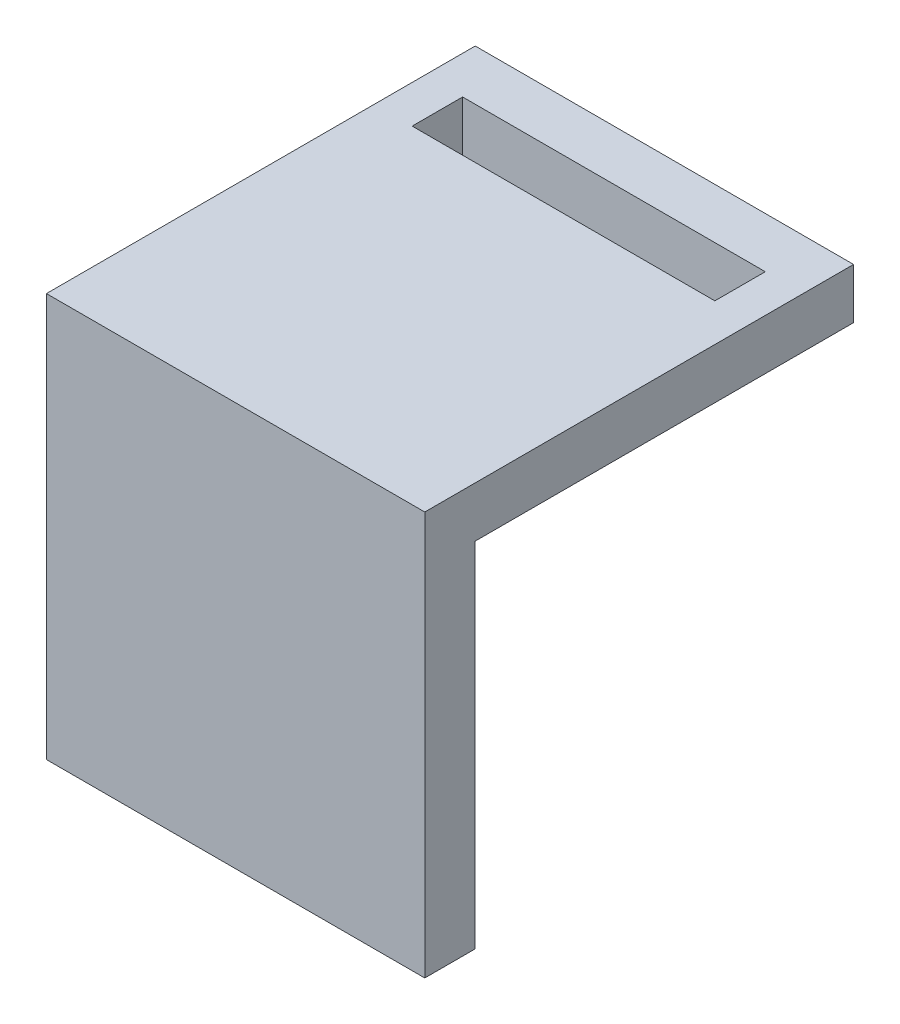
ISO-10303-21;
HEADER;
FILE_DESCRIPTION(('STEP AP214'),'2;1');
FILE_NAME('part.step','',(''),(''),'','','');
FILE_SCHEMA(('AUTOMOTIVE_DESIGN { 1 0 10303 214 1 1 1 1 }'));
ENDSEC;
DATA;
#1=APPLICATION_CONTEXT('core data for automotive mechanical design processes');
#2=APPLICATION_PROTOCOL_DEFINITION('international standard','automotive_design',2000,#1);
#3=PRODUCT_CONTEXT('',#1,'mechanical');
#4=PRODUCT('Part','Part','',(#3));
#5=PRODUCT_RELATED_PRODUCT_CATEGORY('part','',(#4));
#6=PRODUCT_DEFINITION_FORMATION('','',#4);
#7=PRODUCT_DEFINITION_CONTEXT('part definition',#1,'design');
#8=PRODUCT_DEFINITION('design','',#6,#7);
#9=PRODUCT_DEFINITION_SHAPE('','',#8);
#10=(LENGTH_UNIT() NAMED_UNIT(*) SI_UNIT(.MILLI.,.METRE.));
#11=(NAMED_UNIT(*) PLANE_ANGLE_UNIT() SI_UNIT($,.RADIAN.));
#12=(NAMED_UNIT(*) SI_UNIT($,.STERADIAN.) SOLID_ANGLE_UNIT());
#13=UNCERTAINTY_MEASURE_WITH_UNIT(LENGTH_MEASURE(1.E-05),#10,'distance_accuracy_value','');
#14=(GEOMETRIC_REPRESENTATION_CONTEXT(3) GLOBAL_UNCERTAINTY_ASSIGNED_CONTEXT((#13)) GLOBAL_UNIT_ASSIGNED_CONTEXT((#10,
#11,#12)) REPRESENTATION_CONTEXT('',''));
#15=CARTESIAN_POINT('',(0.,0.,0.));
#16=DIRECTION('',(0.,0.,1.));
#17=DIRECTION('',(1.,0.,0.));
#18=AXIS2_PLACEMENT_3D('',#15,#16,#17);
#19=CARTESIAN_POINT('',(-98.9821928985398,20.8954080859731,5.08));
#20=DIRECTION('',(-1.,0.,0.));
#21=DIRECTION('',(0.,0.,1.));
#22=AXIS2_PLACEMENT_3D('',#19,#20,#21);
#23=PLANE('',#22);
#24=DIRECTION('',(0.,1.,0.));
#25=VECTOR('',#24,1.);
#26=CARTESIAN_POINT('',(-98.9821928985398,20.8954080859731,0.));
#27=LINE('',#26,#25);
#28=CARTESIAN_POINT('',(-98.9821928985398,-14.6645919140269,0.));
#29=VERTEX_POINT('',#28);
#30=CARTESIAN_POINT('',(-98.9821928985398,20.8954080859731,0.));
#31=VERTEX_POINT('',#30);
#32=EDGE_CURVE('E128',#29,#31,#27,.T.);
#33=ORIENTED_EDGE('',*,*,#32,.T.);
#34=DIRECTION('',(0.,0.,-1.));
#35=VECTOR('',#34,1.);
#36=CARTESIAN_POINT('',(-98.9821928985398,20.8954080859731,5.08));
#37=LINE('',#36,#35);
#38=CARTESIAN_POINT('',(-98.9821928985398,20.8954080859731,-38.1));
#39=VERTEX_POINT('',#38);
#40=EDGE_CURVE('E169',#31,#39,#37,.T.);
#41=ORIENTED_EDGE('',*,*,#40,.T.);
#42=DIRECTION('',(0.,-1.,0.));
#43=VECTOR('',#42,1.);
#44=CARTESIAN_POINT('',(-98.9821928985398,25.9754080859731,-38.1));
#45=LINE('',#44,#43);
#46=CARTESIAN_POINT('',(-98.9821928985398,25.9754080859731,-38.1));
#47=VERTEX_POINT('',#46);
#48=EDGE_CURVE('E132',#47,#39,#45,.T.);
#49=ORIENTED_EDGE('',*,*,#48,.F.);
#50=DIRECTION('',(0.,0.,-1.));
#51=VECTOR('',#50,1.);
#52=CARTESIAN_POINT('',(-98.9821928985398,25.9754080859731,5.08));
#53=LINE('',#52,#51);
#54=CARTESIAN_POINT('',(-98.9821928985398,25.9754080859731,5.08));
#55=VERTEX_POINT('',#54);
#56=EDGE_CURVE('E194',#55,#47,#53,.T.);
#57=ORIENTED_EDGE('',*,*,#56,.F.);
#58=DIRECTION('',(0.,1.,0.));
#59=VECTOR('',#58,1.);
#60=CARTESIAN_POINT('',(-98.9821928985398,20.8954080859731,5.08));
#61=LINE('',#60,#59);
#62=CARTESIAN_POINT('',(-98.9821928985398,-14.6645919140269,5.08));
#63=VERTEX_POINT('',#62);
#64=EDGE_CURVE('E146',#63,#55,#61,.T.);
#65=ORIENTED_EDGE('',*,*,#64,.F.);
#66=DIRECTION('',(0.,0.,-1.));
#67=VECTOR('',#66,1.);
#68=CARTESIAN_POINT('',(-98.9821928985398,-14.6645919140269,5.08));
#69=LINE('',#68,#67);
#70=EDGE_CURVE('E147',#63,#29,#69,.T.);
#71=ORIENTED_EDGE('',*,*,#70,.T.);
#72=EDGE_LOOP('',(#33,#41,#49,#57,#65,#71));
#73=FACE_BOUND('',#72,.T.);
#74=ADVANCED_FACE('F32',(#73),#23,.F.);
#75=CARTESIAN_POINT('',(-137.08219289854,20.8954080859731,5.08));
#76=DIRECTION('',(1.,0.,0.));
#77=DIRECTION('',(0.,0.,-1.));
#78=AXIS2_PLACEMENT_3D('',#75,#76,#77);
#79=PLANE('',#78);
#80=DIRECTION('',(0.,-1.,0.));
#81=VECTOR('',#80,1.);
#82=CARTESIAN_POINT('',(-137.08219289854,20.8954080859731,0.));
#83=LINE('',#82,#81);
#84=CARTESIAN_POINT('',(-137.08219289854,20.8954080859731,0.));
#85=VERTEX_POINT('',#84);
#86=CARTESIAN_POINT('',(-137.08219289854,-14.6645919140269,0.));
#87=VERTEX_POINT('',#86);
#88=EDGE_CURVE('E136',#85,#87,#83,.T.);
#89=ORIENTED_EDGE('',*,*,#88,.T.);
#90=DIRECTION('',(0.,0.,-1.));
#91=VECTOR('',#90,1.);
#92=CARTESIAN_POINT('',(-137.08219289854,-14.6645919140269,5.08));
#93=LINE('',#92,#91);
#94=CARTESIAN_POINT('',(-137.08219289854,-14.6645919140269,5.08));
#95=VERTEX_POINT('',#94);
#96=EDGE_CURVE('E110',#95,#87,#93,.T.);
#97=ORIENTED_EDGE('',*,*,#96,.F.);
#98=DIRECTION('',(0.,-1.,0.));
#99=VECTOR('',#98,1.);
#100=CARTESIAN_POINT('',(-137.08219289854,20.8954080859731,5.08));
#101=LINE('',#100,#99);
#102=CARTESIAN_POINT('',(-137.08219289854,25.9754080859731,5.08));
#103=VERTEX_POINT('',#102);
#104=EDGE_CURVE('E226',#103,#95,#101,.T.);
#105=ORIENTED_EDGE('',*,*,#104,.F.);
#106=DIRECTION('',(0.,0.,1.));
#107=VECTOR('',#106,1.);
#108=CARTESIAN_POINT('',(-137.08219289854,25.9754080859731,5.08));
#109=LINE('',#108,#107);
#110=CARTESIAN_POINT('',(-137.08219289854,25.9754080859731,-38.1));
#111=VERTEX_POINT('',#110);
#112=EDGE_CURVE('E175',#111,#103,#109,.T.);
#113=ORIENTED_EDGE('',*,*,#112,.F.);
#114=DIRECTION('',(0.,-1.,0.));
#115=VECTOR('',#114,1.);
#116=CARTESIAN_POINT('',(-137.08219289854,25.9754080859731,-38.1));
#117=LINE('',#116,#115);
#118=CARTESIAN_POINT('',(-137.08219289854,20.8954080859731,-38.1));
#119=VERTEX_POINT('',#118);
#120=EDGE_CURVE('E187',#111,#119,#117,.T.);
#121=ORIENTED_EDGE('',*,*,#120,.T.);
#122=DIRECTION('',(0.,0.,1.));
#123=VECTOR('',#122,1.);
#124=CARTESIAN_POINT('',(-137.08219289854,20.8954080859731,5.08));
#125=LINE('',#124,#123);
#126=EDGE_CURVE('E158',#119,#85,#125,.T.);
#127=ORIENTED_EDGE('',*,*,#126,.T.);
#128=EDGE_LOOP('',(#89,#97,#105,#113,#121,#127));
#129=FACE_BOUND('',#128,.T.);
#130=ADVANCED_FACE('F154',(#129),#79,.F.);
#131=CARTESIAN_POINT('',(-137.08219289854,-14.6645919140269,5.08));
#132=DIRECTION('',(0.,1.,0.));
#133=DIRECTION('',(0.,0.,1.));
#134=AXIS2_PLACEMENT_3D('',#131,#132,#133);
#135=PLANE('',#134);
#136=DIRECTION('',(1.,0.,0.));
#137=VECTOR('',#136,1.);
#138=CARTESIAN_POINT('',(-137.08219289854,-14.6645919140269,0.));
#139=LINE('',#138,#137);
#140=EDGE_CURVE('E144',#87,#29,#139,.T.);
#141=ORIENTED_EDGE('',*,*,#140,.T.);
#142=ORIENTED_EDGE('',*,*,#70,.F.);
#143=DIRECTION('',(1.,0.,0.));
#144=VECTOR('',#143,1.);
#145=CARTESIAN_POINT('',(-137.08219289854,-14.6645919140269,5.08));
#146=LINE('',#145,#144);
#147=EDGE_CURVE('E142',#95,#63,#146,.T.);
#148=ORIENTED_EDGE('',*,*,#147,.F.);
#149=ORIENTED_EDGE('',*,*,#96,.T.);
#150=EDGE_LOOP('',(#141,#142,#148,#149));
#151=FACE_BOUND('',#150,.T.);
#152=ADVANCED_FACE('F162',(#151),#135,.F.);
#153=CARTESIAN_POINT('',(-98.9821928985398,-14.6645919140269,5.08));
#154=DIRECTION('',(0.,0.,1.));
#155=DIRECTION('',(1.,0.,0.));
#156=AXIS2_PLACEMENT_3D('',#153,#154,#155);
#157=PLANE('',#156);
#158=ORIENTED_EDGE('',*,*,#64,.T.);
#159=DIRECTION('',(1.,0.,0.));
#160=VECTOR('',#159,1.);
#161=CARTESIAN_POINT('',(-137.08219289854,25.9754080859731,5.08));
#162=LINE('',#161,#160);
#163=EDGE_CURVE('E197',#103,#55,#162,.T.);
#164=ORIENTED_EDGE('',*,*,#163,.F.);
#165=ORIENTED_EDGE('',*,*,#104,.T.);
#166=ORIENTED_EDGE('',*,*,#147,.T.);
#167=EDGE_LOOP('',(#158,#164,#165,#166));
#168=FACE_BOUND('',#167,.T.);
#169=ADVANCED_FACE('F228',(#168),#157,.T.);
#170=CARTESIAN_POINT('',(-98.9821928985398,-14.6645919140269,0.));
#171=DIRECTION('',(0.,0.,1.));
#172=DIRECTION('',(1.,0.,0.));
#173=AXIS2_PLACEMENT_3D('',#170,#171,#172);
#174=PLANE('',#173);
#175=ORIENTED_EDGE('',*,*,#32,.F.);
#176=ORIENTED_EDGE('',*,*,#140,.F.);
#177=ORIENTED_EDGE('',*,*,#88,.F.);
#178=DIRECTION('',(-1.,0.,0.));
#179=VECTOR('',#178,1.);
#180=CARTESIAN_POINT('',(-137.08219289854,20.8954080859731,0.));
#181=LINE('',#180,#179);
#182=EDGE_CURVE('E131',#31,#85,#181,.T.);
#183=ORIENTED_EDGE('',*,*,#182,.F.);
#184=EDGE_LOOP('',(#175,#176,#177,#183));
#185=FACE_BOUND('',#184,.T.);
#186=ADVANCED_FACE('F165',(#185),#174,.F.);
#187=CARTESIAN_POINT('',(-137.08219289854,25.9754080859731,-38.1));
#188=DIRECTION('',(0.,0.,1.));
#189=DIRECTION('',(1.,0.,0.));
#190=AXIS2_PLACEMENT_3D('',#187,#188,#189);
#191=PLANE('',#190);
#192=DIRECTION('',(-1.,0.,0.));
#193=VECTOR('',#192,1.);
#194=CARTESIAN_POINT('',(-137.08219289854,20.8954080859731,-38.1));
#195=LINE('',#194,#193);
#196=EDGE_CURVE('E173',#39,#119,#195,.T.);
#197=ORIENTED_EDGE('',*,*,#196,.T.);
#198=ORIENTED_EDGE('',*,*,#120,.F.);
#199=DIRECTION('',(-1.,0.,0.));
#200=VECTOR('',#199,1.);
#201=CARTESIAN_POINT('',(-137.08219289854,25.9754080859731,-38.1));
#202=LINE('',#201,#200);
#203=EDGE_CURVE('E188',#47,#111,#202,.T.);
#204=ORIENTED_EDGE('',*,*,#203,.F.);
#205=ORIENTED_EDGE('',*,*,#48,.T.);
#206=EDGE_LOOP('',(#197,#198,#204,#205));
#207=FACE_BOUND('',#206,.T.);
#208=ADVANCED_FACE('F191',(#207),#191,.F.);
#209=CARTESIAN_POINT('',(-137.08219289854,25.9754080859731,-38.1));
#210=DIRECTION('',(0.,-1.,0.));
#211=DIRECTION('',(0.,0.,-1.));
#212=AXIS2_PLACEMENT_3D('',#209,#210,#211);
#213=PLANE('',#212);
#214=DIRECTION('',(0.,0.,-1.));
#215=VECTOR('',#214,1.);
#216=CARTESIAN_POINT('',(-102.79219289854,25.9754080859731,-38.1));
#217=LINE('',#216,#215);
#218=CARTESIAN_POINT('',(-102.79219289854,25.9754080859731,-27.94));
#219=VERTEX_POINT('',#218);
#220=CARTESIAN_POINT('',(-102.79219289854,25.9754080859731,-33.02));
#221=VERTEX_POINT('',#220);
#222=EDGE_CURVE('E117',#219,#221,#217,.T.);
#223=ORIENTED_EDGE('',*,*,#222,.F.);
#224=DIRECTION('',(-1.,0.,0.));
#225=VECTOR('',#224,1.);
#226=CARTESIAN_POINT('',(-137.08219289854,25.9754080859731,-27.94));
#227=LINE('',#226,#225);
#228=CARTESIAN_POINT('',(-133.27219289854,25.9754080859731,-27.94));
#229=VERTEX_POINT('',#228);
#230=EDGE_CURVE('E205',#219,#229,#227,.T.);
#231=ORIENTED_EDGE('',*,*,#230,.T.);
#232=DIRECTION('',(0.,0.,1.));
#233=VECTOR('',#232,1.);
#234=CARTESIAN_POINT('',(-133.27219289854,25.9754080859731,-38.1));
#235=LINE('',#234,#233);
#236=CARTESIAN_POINT('',(-133.27219289854,25.9754080859731,-33.02));
#237=VERTEX_POINT('',#236);
#238=EDGE_CURVE('E177',#237,#229,#235,.T.);
#239=ORIENTED_EDGE('',*,*,#238,.F.);
#240=DIRECTION('',(-1.,0.,0.));
#241=VECTOR('',#240,1.);
#242=CARTESIAN_POINT('',(-137.08219289854,25.9754080859731,-33.02));
#243=LINE('',#242,#241);
#244=EDGE_CURVE('E208',#221,#237,#243,.T.);
#245=ORIENTED_EDGE('',*,*,#244,.F.);
#246=EDGE_LOOP('',(#223,#231,#239,#245));
#247=FACE_BOUND('',#246,.T.);
#248=ORIENTED_EDGE('',*,*,#112,.T.);
#249=ORIENTED_EDGE('',*,*,#163,.T.);
#250=ORIENTED_EDGE('',*,*,#56,.T.);
#251=ORIENTED_EDGE('',*,*,#203,.T.);
#252=EDGE_LOOP('',(#248,#249,#250,#251));
#253=FACE_BOUND('',#252,.T.);
#254=ADVANCED_FACE('F221',(#247,#253),#213,.F.);
#255=CARTESIAN_POINT('',(-137.08219289854,20.8954080859731,-38.1));
#256=DIRECTION('',(0.,-1.,0.));
#257=DIRECTION('',(0.,0.,-1.));
#258=AXIS2_PLACEMENT_3D('',#255,#256,#257);
#259=PLANE('',#258);
#260=DIRECTION('',(-1.,0.,0.));
#261=VECTOR('',#260,1.);
#262=CARTESIAN_POINT('',(-137.08219289854,20.8954080859731,-27.94));
#263=LINE('',#262,#261);
#264=CARTESIAN_POINT('',(-102.79219289854,20.8954080859731,-27.94));
#265=VERTEX_POINT('',#264);
#266=CARTESIAN_POINT('',(-133.27219289854,20.8954080859731,-27.94));
#267=VERTEX_POINT('',#266);
#268=EDGE_CURVE('E11',#265,#267,#263,.T.);
#269=ORIENTED_EDGE('',*,*,#268,.F.);
#270=DIRECTION('',(0.,0.,-1.));
#271=VECTOR('',#270,1.);
#272=CARTESIAN_POINT('',(-102.79219289854,20.8954080859731,-38.1));
#273=LINE('',#272,#271);
#274=CARTESIAN_POINT('',(-102.79219289854,20.8954080859731,-33.02));
#275=VERTEX_POINT('',#274);
#276=EDGE_CURVE('E109',#265,#275,#273,.T.);
#277=ORIENTED_EDGE('',*,*,#276,.T.);
#278=DIRECTION('',(-1.,0.,0.));
#279=VECTOR('',#278,1.);
#280=CARTESIAN_POINT('',(-137.08219289854,20.8954080859731,-33.02));
#281=LINE('',#280,#279);
#282=CARTESIAN_POINT('',(-133.27219289854,20.8954080859731,-33.02));
#283=VERTEX_POINT('',#282);
#284=EDGE_CURVE('E104',#275,#283,#281,.T.);
#285=ORIENTED_EDGE('',*,*,#284,.T.);
#286=DIRECTION('',(0.,0.,1.));
#287=VECTOR('',#286,1.);
#288=CARTESIAN_POINT('',(-133.27219289854,20.8954080859731,-38.1));
#289=LINE('',#288,#287);
#290=EDGE_CURVE('E39',#283,#267,#289,.T.);
#291=ORIENTED_EDGE('',*,*,#290,.T.);
#292=EDGE_LOOP('',(#269,#277,#285,#291));
#293=FACE_BOUND('',#292,.T.);
#294=ORIENTED_EDGE('',*,*,#40,.F.);
#295=ORIENTED_EDGE('',*,*,#182,.T.);
#296=ORIENTED_EDGE('',*,*,#126,.F.);
#297=ORIENTED_EDGE('',*,*,#196,.F.);
#298=EDGE_LOOP('',(#294,#295,#296,#297));
#299=FACE_BOUND('',#298,.T.);
#300=ADVANCED_FACE('F122',(#293,#299),#259,.T.);
#301=CARTESIAN_POINT('',(-133.27219289854,-14.8540776052966,-27.94));
#302=DIRECTION('',(1.,0.,0.));
#303=DIRECTION('',(0.,0.,-1.));
#304=AXIS2_PLACEMENT_3D('',#301,#302,#303);
#305=PLANE('',#304);
#306=ORIENTED_EDGE('',*,*,#238,.T.);
#307=DIRECTION('',(0.,-1.,0.));
#308=VECTOR('',#307,1.);
#309=CARTESIAN_POINT('',(-133.27219289854,-14.8540776052966,-27.94));
#310=LINE('',#309,#308);
#311=EDGE_CURVE('E119',#229,#267,#310,.T.);
#312=ORIENTED_EDGE('',*,*,#311,.T.);
#313=ORIENTED_EDGE('',*,*,#290,.F.);
#314=DIRECTION('',(0.,-1.,0.));
#315=VECTOR('',#314,1.);
#316=CARTESIAN_POINT('',(-133.27219289854,-14.8540776052966,-33.02));
#317=LINE('',#316,#315);
#318=EDGE_CURVE('E51',#237,#283,#317,.T.);
#319=ORIENTED_EDGE('',*,*,#318,.F.);
#320=EDGE_LOOP('',(#306,#312,#313,#319));
#321=FACE_BOUND('',#320,.T.);
#322=ADVANCED_FACE('F216',(#321),#305,.T.);
#323=CARTESIAN_POINT('',(-102.79219289854,-14.8540776052966,-27.94));
#324=DIRECTION('',(-1.,0.,0.));
#325=DIRECTION('',(0.,0.,1.));
#326=AXIS2_PLACEMENT_3D('',#323,#324,#325);
#327=PLANE('',#326);
#328=ORIENTED_EDGE('',*,*,#222,.T.);
#329=DIRECTION('',(0.,1.,0.));
#330=VECTOR('',#329,1.);
#331=CARTESIAN_POINT('',(-102.79219289854,-14.8540776052966,-33.02));
#332=LINE('',#331,#330);
#333=EDGE_CURVE('E46',#275,#221,#332,.T.);
#334=ORIENTED_EDGE('',*,*,#333,.F.);
#335=ORIENTED_EDGE('',*,*,#276,.F.);
#336=DIRECTION('',(0.,1.,0.));
#337=VECTOR('',#336,1.);
#338=CARTESIAN_POINT('',(-102.79219289854,-14.8540776052966,-27.94));
#339=LINE('',#338,#337);
#340=EDGE_CURVE('E209',#265,#219,#339,.T.);
#341=ORIENTED_EDGE('',*,*,#340,.T.);
#342=EDGE_LOOP('',(#328,#334,#335,#341));
#343=FACE_BOUND('',#342,.T.);
#344=ADVANCED_FACE('F113',(#343),#327,.T.);
#345=CARTESIAN_POINT('',(-102.79219289854,61.3459223947034,-27.94));
#346=DIRECTION('',(0.,0.,1.));
#347=DIRECTION('',(0.,1.,0.));
#348=AXIS2_PLACEMENT_3D('',#345,#346,#347);
#349=PLANE('',#348);
#350=ORIENTED_EDGE('',*,*,#340,.F.);
#351=ORIENTED_EDGE('',*,*,#268,.T.);
#352=ORIENTED_EDGE('',*,*,#311,.F.);
#353=ORIENTED_EDGE('',*,*,#230,.F.);
#354=EDGE_LOOP('',(#350,#351,#352,#353));
#355=FACE_BOUND('',#354,.T.);
#356=ADVANCED_FACE('F219',(#355),#349,.F.);
#357=CARTESIAN_POINT('',(-102.79219289854,61.3459223947034,-33.02));
#358=DIRECTION('',(0.,0.,1.));
#359=DIRECTION('',(0.,1.,0.));
#360=AXIS2_PLACEMENT_3D('',#357,#358,#359);
#361=PLANE('',#360);
#362=ORIENTED_EDGE('',*,*,#244,.T.);
#363=ORIENTED_EDGE('',*,*,#318,.T.);
#364=ORIENTED_EDGE('',*,*,#284,.F.);
#365=ORIENTED_EDGE('',*,*,#333,.T.);
#366=EDGE_LOOP('',(#362,#363,#364,#365));
#367=FACE_BOUND('',#366,.T.);
#368=ADVANCED_FACE('F105',(#367),#361,.T.);
#369=CLOSED_SHELL('',(#74,#130,#152,#169,#186,#208,#254,#300,#322,#344,#356,#368));
#370=MANIFOLD_SOLID_BREP('B2',#369);
#371=ADVANCED_BREP_SHAPE_REPRESENTATION('',(#18,#370),#14);
#372=SHAPE_DEFINITION_REPRESENTATION(#9,#371);
ENDSEC;
END-ISO-10303-21;
